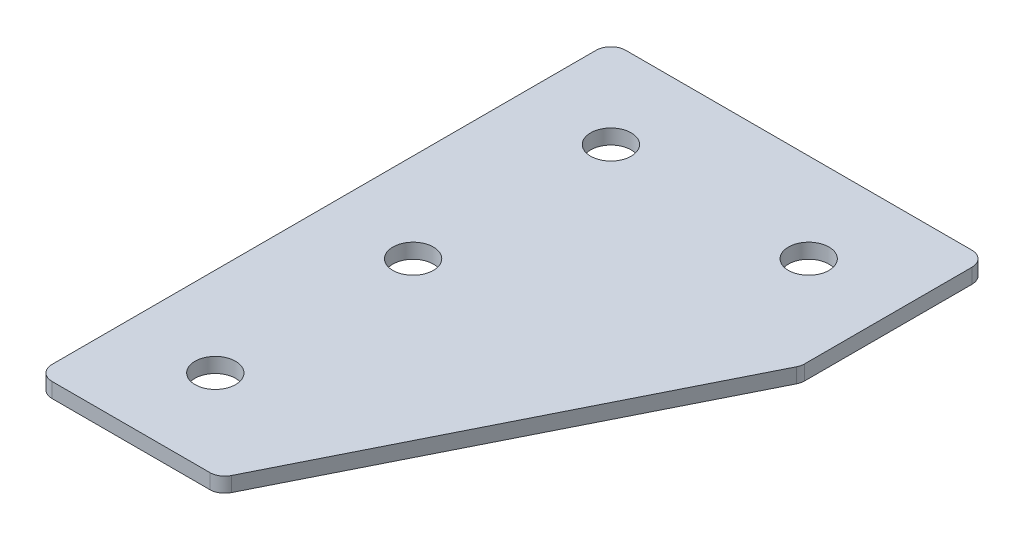
ISO-10303-21;
HEADER;
FILE_DESCRIPTION(('STEP AP214'),'2;1');
FILE_NAME('part.step','',(''),(''),'','','');
FILE_SCHEMA(('AUTOMOTIVE_DESIGN { 1 0 10303 214 1 1 1 1 }'));
ENDSEC;
DATA;
#1=APPLICATION_CONTEXT('core data for automotive mechanical design processes');
#2=APPLICATION_PROTOCOL_DEFINITION('international standard','automotive_design',2000,#1);
#3=PRODUCT_CONTEXT('',#1,'mechanical');
#4=PRODUCT('Part','Part','',(#3));
#5=PRODUCT_RELATED_PRODUCT_CATEGORY('part','',(#4));
#6=PRODUCT_DEFINITION_FORMATION('','',#4);
#7=PRODUCT_DEFINITION_CONTEXT('part definition',#1,'design');
#8=PRODUCT_DEFINITION('design','',#6,#7);
#9=PRODUCT_DEFINITION_SHAPE('','',#8);
#10=(LENGTH_UNIT() NAMED_UNIT(*) SI_UNIT(.MILLI.,.METRE.));
#11=(NAMED_UNIT(*) PLANE_ANGLE_UNIT() SI_UNIT($,.RADIAN.));
#12=(NAMED_UNIT(*) SI_UNIT($,.STERADIAN.) SOLID_ANGLE_UNIT());
#13=UNCERTAINTY_MEASURE_WITH_UNIT(LENGTH_MEASURE(1.E-05),#10,'distance_accuracy_value','');
#14=(GEOMETRIC_REPRESENTATION_CONTEXT(3) GLOBAL_UNCERTAINTY_ASSIGNED_CONTEXT((#13)) GLOBAL_UNIT_ASSIGNED_CONTEXT((#10,
#11,#12)) REPRESENTATION_CONTEXT('',''));
#15=CARTESIAN_POINT('',(0.,0.,0.));
#16=DIRECTION('',(0.,0.,1.));
#17=DIRECTION('',(1.,0.,0.));
#18=AXIS2_PLACEMENT_3D('',#15,#16,#17);
#19=CARTESIAN_POINT('',(-21.4535127194222,1.20798729377475,-41.2540344861804));
#20=DIRECTION('',(0.,-1.,0.));
#21=DIRECTION('',(0.,0.,-1.));
#22=AXIS2_PLACEMENT_3D('',#19,#20,#21);
#23=PLANE('',#22);
#24=CARTESIAN_POINT('',(-21.4535127194222,1.20798729377475,38.7459655138196));
#25=DIRECTION('',(0.,1.,0.));
#26=DIRECTION('',(0.,0.,1.));
#27=AXIS2_PLACEMENT_3D('',#24,#25,#26);
#28=CIRCLE('',#27,4.1);
#29=CARTESIAN_POINT('',(-21.4535127194222,1.20798729377475,42.8459655138196));
#30=VERTEX_POINT('',#29);
#31=EDGE_CURVE('E245',#30,#30,#28,.T.);
#32=ORIENTED_EDGE('',*,*,#31,.T.);
#33=EDGE_LOOP('',(#32));
#34=FACE_BOUND('',#33,.T.);
#35=CARTESIAN_POINT('',(-21.4535127194222,1.20798729377475,-1.25403448618041));
#36=DIRECTION('',(0.,1.,0.));
#37=DIRECTION('',(0.,0.,1.));
#38=AXIS2_PLACEMENT_3D('',#35,#36,#37);
#39=CIRCLE('',#38,4.1);
#40=CARTESIAN_POINT('',(-21.4535127194222,1.20798729377475,2.84596551381959));
#41=VERTEX_POINT('',#40);
#42=EDGE_CURVE('E253',#41,#41,#39,.T.);
#43=ORIENTED_EDGE('',*,*,#42,.T.);
#44=EDGE_LOOP('',(#43));
#45=FACE_BOUND('',#44,.T.);
#46=CARTESIAN_POINT('',(18.5464872805778,1.20798729377475,-41.2540344861804));
#47=DIRECTION('',(0.,1.,0.));
#48=DIRECTION('',(0.,0.,1.));
#49=AXIS2_PLACEMENT_3D('',#46,#47,#48);
#50=CIRCLE('',#49,4.1);
#51=CARTESIAN_POINT('',(18.5464872805778,1.20798729377475,-37.1540344861804));
#52=VERTEX_POINT('',#51);
#53=EDGE_CURVE('E259',#52,#52,#50,.T.);
#54=ORIENTED_EDGE('',*,*,#53,.T.);
#55=EDGE_LOOP('',(#54));
#56=FACE_BOUND('',#55,.T.);
#57=CARTESIAN_POINT('',(-21.4535127194222,1.20798729377475,-41.2540344861804));
#58=DIRECTION('',(0.,1.,0.));
#59=DIRECTION('',(0.,0.,1.));
#60=AXIS2_PLACEMENT_3D('',#57,#58,#59);
#61=CIRCLE('',#60,4.1);
#62=CARTESIAN_POINT('',(-21.4535127194222,1.20798729377475,-37.1540344861804));
#63=VERTEX_POINT('',#62);
#64=EDGE_CURVE('E176',#63,#63,#61,.T.);
#65=ORIENTED_EDGE('',*,*,#64,.T.);
#66=EDGE_LOOP('',(#65));
#67=FACE_BOUND('',#66,.T.);
#68=DIRECTION('',(1.,0.,0.));
#69=VECTOR('',#68,1.);
#70=CARTESIAN_POINT('',(-39.4535127194222,1.20798729377475,56.7459655138196));
#71=LINE('',#70,#69);
#72=CARTESIAN_POINT('',(-36.4535127194222,1.20798729377475,56.7459655138196));
#73=VERTEX_POINT('',#72);
#74=CARTESIAN_POINT('',(-4.54368266317168,1.20798729377475,56.7459655138196));
#75=VERTEX_POINT('',#74);
#76=EDGE_CURVE('E165',#73,#75,#71,.T.);
#77=ORIENTED_EDGE('',*,*,#76,.F.);
#78=CARTESIAN_POINT('',(-36.4535127194222,1.20798729377475,53.7459655138196));
#79=DIRECTION('',(0.,-1.,0.));
#80=DIRECTION('',(0.,0.,-1.));
#81=AXIS2_PLACEMENT_3D('',#78,#79,#80);
#82=CIRCLE('',#81,3.);
#83=CARTESIAN_POINT('',(-39.4535127194222,1.20798729377475,53.7459655138196));
#84=VERTEX_POINT('',#83);
#85=EDGE_CURVE('E146',#73,#84,#82,.T.);
#86=ORIENTED_EDGE('',*,*,#85,.T.);
#87=DIRECTION('',(0.,0.,1.));
#88=VECTOR('',#87,1.);
#89=CARTESIAN_POINT('',(-39.4535127194222,1.20798729377475,-59.2540344861804));
#90=LINE('',#89,#88);
#91=CARTESIAN_POINT('',(-39.4535127194222,1.20798729377475,-56.2540344861804));
#92=VERTEX_POINT('',#91);
#93=EDGE_CURVE('E163',#92,#84,#90,.T.);
#94=ORIENTED_EDGE('',*,*,#93,.F.);
#95=CARTESIAN_POINT('',(-36.4535127194222,1.20798729377475,-56.2540344861804));
#96=DIRECTION('',(0.,-1.,0.));
#97=DIRECTION('',(0.,0.,-1.));
#98=AXIS2_PLACEMENT_3D('',#95,#96,#97);
#99=CIRCLE('',#98,3.);
#100=CARTESIAN_POINT('',(-36.4535127194222,1.20798729377475,-59.2540344861804));
#101=VERTEX_POINT('',#100);
#102=EDGE_CURVE('E117',#92,#101,#99,.T.);
#103=ORIENTED_EDGE('',*,*,#102,.T.);
#104=DIRECTION('',(-1.,0.,0.));
#105=VECTOR('',#104,1.);
#106=CARTESIAN_POINT('',(36.5464872805778,1.20798729377475,-59.2540344861804));
#107=LINE('',#106,#105);
#108=CARTESIAN_POINT('',(33.5464872805778,1.20798729377475,-59.2540344861804));
#109=VERTEX_POINT('',#108);
#110=EDGE_CURVE('E161',#109,#101,#107,.T.);
#111=ORIENTED_EDGE('',*,*,#110,.F.);
#112=CARTESIAN_POINT('',(33.5464872805778,1.20798729377475,-56.2540344861804));
#113=DIRECTION('',(0.,-1.,0.));
#114=DIRECTION('',(0.,0.,-1.));
#115=AXIS2_PLACEMENT_3D('',#112,#113,#114);
#116=CIRCLE('',#115,3.);
#117=CARTESIAN_POINT('',(36.5464872805778,1.20798729377475,-56.2540344861804));
#118=VERTEX_POINT('',#117);
#119=EDGE_CURVE('E141',#109,#118,#116,.T.);
#120=ORIENTED_EDGE('',*,*,#119,.T.);
#121=DIRECTION('',(0.,0.,-1.));
#122=VECTOR('',#121,1.);
#123=CARTESIAN_POINT('',(36.5464872805778,1.20798729377475,-21.72617044118));
#124=LINE('',#123,#122);
#125=CARTESIAN_POINT('',(36.5464872805778,1.20798729377475,-22.4343743736794));
#126=VERTEX_POINT('',#125);
#127=EDGE_CURVE('E118',#126,#118,#124,.T.);
#128=ORIENTED_EDGE('',*,*,#127,.F.);
#129=CARTESIAN_POINT('',(33.5464872805778,1.20798729377475,-22.4343743736794));
#130=DIRECTION('',(0.,-1.,0.));
#131=DIRECTION('',(0.,0.,-1.));
#132=AXIS2_PLACEMENT_3D('',#129,#130,#131);
#133=CIRCLE('',#132,3.);
#134=CARTESIAN_POINT('',(36.2297688535776,1.20798729377475,-21.0927335871795));
#135=VERTEX_POINT('',#134);
#136=EDGE_CURVE('E31',#126,#135,#133,.T.);
#137=ORIENTED_EDGE('',*,*,#136,.T.);
#138=DIRECTION('',(0.447213595499958,0.,-0.894427190999916));
#139=VECTOR('',#138,1.);
#140=CARTESIAN_POINT('',(-2.68958069692201,1.20798729377475,56.7459655138196));
#141=LINE('',#140,#139);
#142=CARTESIAN_POINT('',(-1.86040109017194,1.20798729377475,55.0876063003194));
#143=VERTEX_POINT('',#142);
#144=EDGE_CURVE('E122',#143,#135,#141,.T.);
#145=ORIENTED_EDGE('',*,*,#144,.F.);
#146=CARTESIAN_POINT('',(-4.54368266317168,1.20798729377475,53.7459655138196));
#147=DIRECTION('',(0.,-1.,0.));
#148=DIRECTION('',(0.,0.,-1.));
#149=AXIS2_PLACEMENT_3D('',#146,#147,#148);
#150=CIRCLE('',#149,3.);
#151=EDGE_CURVE('E144',#143,#75,#150,.T.);
#152=ORIENTED_EDGE('',*,*,#151,.T.);
#153=EDGE_LOOP('',(#77,#86,#94,#103,#111,#120,#128,#137,#145,#152));
#154=FACE_BOUND('',#153,.T.);
#155=ADVANCED_FACE('F16',(#34,#45,#56,#67,#154),#23,.T.);
#156=CARTESIAN_POINT('',(36.5464872805778,1.20798729377475,-59.2540344861804));
#157=DIRECTION('',(0.,0.,-1.));
#158=DIRECTION('',(-1.,0.,0.));
#159=AXIS2_PLACEMENT_3D('',#156,#157,#158);
#160=PLANE('',#159);
#161=DIRECTION('',(-1.,0.,0.));
#162=VECTOR('',#161,1.);
#163=CARTESIAN_POINT('',(36.5464872805778,4.20798729377475,-59.2540344861804));
#164=LINE('',#163,#162);
#165=CARTESIAN_POINT('',(33.5464872805778,4.20798729377475,-59.2540344861804));
#166=VERTEX_POINT('',#165);
#167=CARTESIAN_POINT('',(-36.4535127194222,4.20798729377475,-59.2540344861804));
#168=VERTEX_POINT('',#167);
#169=EDGE_CURVE('E99',#166,#168,#164,.T.);
#170=ORIENTED_EDGE('',*,*,#169,.F.);
#171=DIRECTION('',(0.,1.,0.));
#172=VECTOR('',#171,1.);
#173=CARTESIAN_POINT('',(33.5464872805778,1.20798729377475,-59.2540344861804));
#174=LINE('',#173,#172);
#175=EDGE_CURVE('E10',#166,#109,#174,.F.);
#176=ORIENTED_EDGE('',*,*,#175,.T.);
#177=ORIENTED_EDGE('',*,*,#110,.T.);
#178=DIRECTION('',(0.,1.,0.));
#179=VECTOR('',#178,1.);
#180=CARTESIAN_POINT('',(-36.4535127194222,1.20798729377475,-59.2540344861804));
#181=LINE('',#180,#179);
#182=EDGE_CURVE('E24',#101,#168,#181,.T.);
#183=ORIENTED_EDGE('',*,*,#182,.T.);
#184=EDGE_LOOP('',(#170,#176,#177,#183));
#185=FACE_BOUND('',#184,.T.);
#186=ADVANCED_FACE('F158',(#185),#160,.T.);
#187=CARTESIAN_POINT('',(36.5464872805778,1.20798729377475,-21.72617044118));
#188=DIRECTION('',(1.,0.,0.));
#189=DIRECTION('',(0.,0.,-1.));
#190=AXIS2_PLACEMENT_3D('',#187,#188,#189);
#191=PLANE('',#190);
#192=DIRECTION('',(0.,0.,-1.));
#193=VECTOR('',#192,1.);
#194=CARTESIAN_POINT('',(36.5464872805778,4.20798729377475,-21.72617044118));
#195=LINE('',#194,#193);
#196=CARTESIAN_POINT('',(36.5464872805778,4.20798729377475,-22.4343743736794));
#197=VERTEX_POINT('',#196);
#198=CARTESIAN_POINT('',(36.5464872805778,4.20798729377475,-56.2540344861804));
#199=VERTEX_POINT('',#198);
#200=EDGE_CURVE('E125',#197,#199,#195,.T.);
#201=ORIENTED_EDGE('',*,*,#200,.F.);
#202=DIRECTION('',(0.,1.,0.));
#203=VECTOR('',#202,1.);
#204=CARTESIAN_POINT('',(36.5464872805778,1.20798729377475,-22.4343743736794));
#205=LINE('',#204,#203);
#206=EDGE_CURVE('E155',#197,#126,#205,.F.);
#207=ORIENTED_EDGE('',*,*,#206,.T.);
#208=ORIENTED_EDGE('',*,*,#127,.T.);
#209=DIRECTION('',(0.,1.,0.));
#210=VECTOR('',#209,1.);
#211=CARTESIAN_POINT('',(36.5464872805778,1.20798729377475,-56.2540344861804));
#212=LINE('',#211,#210);
#213=EDGE_CURVE('E152',#118,#199,#212,.T.);
#214=ORIENTED_EDGE('',*,*,#213,.T.);
#215=EDGE_LOOP('',(#201,#207,#208,#214));
#216=FACE_BOUND('',#215,.T.);
#217=ADVANCED_FACE('F212',(#216),#191,.T.);
#218=CARTESIAN_POINT('',(-2.68958069692201,1.20798729377475,56.7459655138196));
#219=DIRECTION('',(0.894427190999916,0.,0.447213595499958));
#220=DIRECTION('',(0.447213595499958,0.,-0.894427190999916));
#221=AXIS2_PLACEMENT_3D('',#218,#219,#220);
#222=PLANE('',#221);
#223=DIRECTION('',(0.447213595499958,0.,-0.894427190999916));
#224=VECTOR('',#223,1.);
#225=CARTESIAN_POINT('',(-2.68958069692201,4.20798729377475,56.7459655138196));
#226=LINE('',#225,#224);
#227=CARTESIAN_POINT('',(-1.86040109017194,4.20798729377475,55.0876063003194));
#228=VERTEX_POINT('',#227);
#229=CARTESIAN_POINT('',(36.2297688535776,4.20798729377475,-21.0927335871795));
#230=VERTEX_POINT('',#229);
#231=EDGE_CURVE('E168',#228,#230,#226,.T.);
#232=ORIENTED_EDGE('',*,*,#231,.F.);
#233=DIRECTION('',(0.,1.,0.));
#234=VECTOR('',#233,1.);
#235=CARTESIAN_POINT('',(-1.86040109017194,1.20798729377475,55.0876063003194));
#236=LINE('',#235,#234);
#237=EDGE_CURVE('E38',#228,#143,#236,.F.);
#238=ORIENTED_EDGE('',*,*,#237,.T.);
#239=ORIENTED_EDGE('',*,*,#144,.T.);
#240=DIRECTION('',(0.,1.,0.));
#241=VECTOR('',#240,1.);
#242=CARTESIAN_POINT('',(36.2297688535776,1.20798729377475,-21.0927335871795));
#243=LINE('',#242,#241);
#244=EDGE_CURVE('E148',#135,#230,#243,.T.);
#245=ORIENTED_EDGE('',*,*,#244,.T.);
#246=EDGE_LOOP('',(#232,#238,#239,#245));
#247=FACE_BOUND('',#246,.T.);
#248=ADVANCED_FACE('F181',(#247),#222,.T.);
#249=CARTESIAN_POINT('',(-39.4535127194222,1.20798729377475,56.7459655138196));
#250=DIRECTION('',(0.,0.,1.));
#251=DIRECTION('',(1.,0.,0.));
#252=AXIS2_PLACEMENT_3D('',#249,#250,#251);
#253=PLANE('',#252);
#254=DIRECTION('',(1.,0.,0.));
#255=VECTOR('',#254,1.);
#256=CARTESIAN_POINT('',(-39.4535127194222,4.20798729377475,56.7459655138196));
#257=LINE('',#256,#255);
#258=CARTESIAN_POINT('',(-36.4535127194222,4.20798729377475,56.7459655138196));
#259=VERTEX_POINT('',#258);
#260=CARTESIAN_POINT('',(-4.54368266317168,4.20798729377475,56.7459655138196));
#261=VERTEX_POINT('',#260);
#262=EDGE_CURVE('E114',#259,#261,#257,.T.);
#263=ORIENTED_EDGE('',*,*,#262,.F.);
#264=DIRECTION('',(0.,1.,0.));
#265=VECTOR('',#264,1.);
#266=CARTESIAN_POINT('',(-36.4535127194222,1.20798729377475,56.7459655138196));
#267=LINE('',#266,#265);
#268=EDGE_CURVE('E138',#259,#73,#267,.F.);
#269=ORIENTED_EDGE('',*,*,#268,.T.);
#270=ORIENTED_EDGE('',*,*,#76,.T.);
#271=DIRECTION('',(0.,1.,0.));
#272=VECTOR('',#271,1.);
#273=CARTESIAN_POINT('',(-4.54368266317168,1.20798729377475,56.7459655138196));
#274=LINE('',#273,#272);
#275=EDGE_CURVE('E135',#75,#261,#274,.T.);
#276=ORIENTED_EDGE('',*,*,#275,.T.);
#277=EDGE_LOOP('',(#263,#269,#270,#276));
#278=FACE_BOUND('',#277,.T.);
#279=ADVANCED_FACE('F191',(#278),#253,.T.);
#280=CARTESIAN_POINT('',(-39.4535127194222,1.20798729377475,-59.2540344861804));
#281=DIRECTION('',(-1.,0.,0.));
#282=DIRECTION('',(0.,0.,1.));
#283=AXIS2_PLACEMENT_3D('',#280,#281,#282);
#284=PLANE('',#283);
#285=ORIENTED_EDGE('',*,*,#93,.T.);
#286=DIRECTION('',(0.,1.,0.));
#287=VECTOR('',#286,1.);
#288=CARTESIAN_POINT('',(-39.4535127194222,1.20798729377475,53.7459655138196));
#289=LINE('',#288,#287);
#290=CARTESIAN_POINT('',(-39.4535127194222,4.20798729377475,53.7459655138196));
#291=VERTEX_POINT('',#290);
#292=EDGE_CURVE('E105',#84,#291,#289,.T.);
#293=ORIENTED_EDGE('',*,*,#292,.T.);
#294=DIRECTION('',(0.,0.,1.));
#295=VECTOR('',#294,1.);
#296=CARTESIAN_POINT('',(-39.4535127194222,4.20798729377475,-59.2540344861804));
#297=LINE('',#296,#295);
#298=CARTESIAN_POINT('',(-39.4535127194222,4.20798729377475,-56.2540344861804));
#299=VERTEX_POINT('',#298);
#300=EDGE_CURVE('E97',#299,#291,#297,.T.);
#301=ORIENTED_EDGE('',*,*,#300,.F.);
#302=DIRECTION('',(0.,1.,0.));
#303=VECTOR('',#302,1.);
#304=CARTESIAN_POINT('',(-39.4535127194222,1.20798729377475,-56.2540344861804));
#305=LINE('',#304,#303);
#306=EDGE_CURVE('E111',#299,#92,#305,.F.);
#307=ORIENTED_EDGE('',*,*,#306,.T.);
#308=EDGE_LOOP('',(#285,#293,#301,#307));
#309=FACE_BOUND('',#308,.T.);
#310=ADVANCED_FACE('F110',(#309),#284,.T.);
#311=CARTESIAN_POINT('',(-21.4535127194222,4.20798729377475,-41.2540344861804));
#312=DIRECTION('',(0.,-1.,0.));
#313=DIRECTION('',(0.,0.,-1.));
#314=AXIS2_PLACEMENT_3D('',#311,#312,#313);
#315=PLANE('',#314);
#316=CARTESIAN_POINT('',(-21.4535127194222,4.20798729377475,38.7459655138196));
#317=DIRECTION('',(0.,1.,0.));
#318=DIRECTION('',(0.,0.,1.));
#319=AXIS2_PLACEMENT_3D('',#316,#317,#318);
#320=CIRCLE('',#319,4.1);
#321=CARTESIAN_POINT('',(-21.4535127194222,4.20798729377475,42.8459655138196));
#322=VERTEX_POINT('',#321);
#323=EDGE_CURVE('E248',#322,#322,#320,.T.);
#324=ORIENTED_EDGE('',*,*,#323,.F.);
#325=EDGE_LOOP('',(#324));
#326=FACE_BOUND('',#325,.T.);
#327=CARTESIAN_POINT('',(-21.4535127194222,4.20798729377475,-1.25403448618041));
#328=DIRECTION('',(0.,1.,0.));
#329=DIRECTION('',(0.,0.,1.));
#330=AXIS2_PLACEMENT_3D('',#327,#328,#329);
#331=CIRCLE('',#330,4.1);
#332=CARTESIAN_POINT('',(-21.4535127194222,4.20798729377475,2.84596551381959));
#333=VERTEX_POINT('',#332);
#334=EDGE_CURVE('E250',#333,#333,#331,.T.);
#335=ORIENTED_EDGE('',*,*,#334,.F.);
#336=EDGE_LOOP('',(#335));
#337=FACE_BOUND('',#336,.T.);
#338=CARTESIAN_POINT('',(18.5464872805778,4.20798729377475,-41.2540344861804));
#339=DIRECTION('',(0.,1.,0.));
#340=DIRECTION('',(0.,0.,1.));
#341=AXIS2_PLACEMENT_3D('',#338,#339,#340);
#342=CIRCLE('',#341,4.1);
#343=CARTESIAN_POINT('',(18.5464872805778,4.20798729377475,-37.1540344861804));
#344=VERTEX_POINT('',#343);
#345=EDGE_CURVE('E256',#344,#344,#342,.T.);
#346=ORIENTED_EDGE('',*,*,#345,.F.);
#347=EDGE_LOOP('',(#346));
#348=FACE_BOUND('',#347,.T.);
#349=CARTESIAN_POINT('',(-21.4535127194222,4.20798729377475,-41.2540344861804));
#350=DIRECTION('',(0.,1.,0.));
#351=DIRECTION('',(0.,0.,1.));
#352=AXIS2_PLACEMENT_3D('',#349,#350,#351);
#353=CIRCLE('',#352,4.1);
#354=CARTESIAN_POINT('',(-21.4535127194222,4.20798729377475,-37.1540344861804));
#355=VERTEX_POINT('',#354);
#356=EDGE_CURVE('E170',#355,#355,#353,.T.);
#357=ORIENTED_EDGE('',*,*,#356,.F.);
#358=EDGE_LOOP('',(#357));
#359=FACE_BOUND('',#358,.T.);
#360=ORIENTED_EDGE('',*,*,#300,.T.);
#361=CARTESIAN_POINT('',(-36.4535127194222,4.20798729377475,53.7459655138196));
#362=DIRECTION('',(0.,-1.,0.));
#363=DIRECTION('',(0.,0.,-1.));
#364=AXIS2_PLACEMENT_3D('',#361,#362,#363);
#365=CIRCLE('',#364,3.);
#366=EDGE_CURVE('E133',#291,#259,#365,.F.);
#367=ORIENTED_EDGE('',*,*,#366,.T.);
#368=ORIENTED_EDGE('',*,*,#262,.T.);
#369=CARTESIAN_POINT('',(-4.54368266317168,4.20798729377475,53.7459655138196));
#370=DIRECTION('',(0.,-1.,0.));
#371=DIRECTION('',(0.,0.,-1.));
#372=AXIS2_PLACEMENT_3D('',#369,#370,#371);
#373=CIRCLE('',#372,3.);
#374=EDGE_CURVE('E131',#261,#228,#373,.F.);
#375=ORIENTED_EDGE('',*,*,#374,.T.);
#376=ORIENTED_EDGE('',*,*,#231,.T.);
#377=CARTESIAN_POINT('',(33.5464872805778,4.20798729377475,-22.4343743736794));
#378=DIRECTION('',(0.,-1.,0.));
#379=DIRECTION('',(0.,0.,-1.));
#380=AXIS2_PLACEMENT_3D('',#377,#378,#379);
#381=CIRCLE('',#380,3.);
#382=EDGE_CURVE('E129',#230,#197,#381,.F.);
#383=ORIENTED_EDGE('',*,*,#382,.T.);
#384=ORIENTED_EDGE('',*,*,#200,.T.);
#385=CARTESIAN_POINT('',(33.5464872805778,4.20798729377475,-56.2540344861804));
#386=DIRECTION('',(0.,-1.,0.));
#387=DIRECTION('',(0.,0.,-1.));
#388=AXIS2_PLACEMENT_3D('',#385,#386,#387);
#389=CIRCLE('',#388,3.);
#390=EDGE_CURVE('E104',#199,#166,#389,.F.);
#391=ORIENTED_EDGE('',*,*,#390,.T.);
#392=ORIENTED_EDGE('',*,*,#169,.T.);
#393=CARTESIAN_POINT('',(-36.4535127194222,4.20798729377475,-56.2540344861804));
#394=DIRECTION('',(0.,-1.,0.));
#395=DIRECTION('',(0.,0.,-1.));
#396=AXIS2_PLACEMENT_3D('',#393,#394,#395);
#397=CIRCLE('',#396,3.);
#398=EDGE_CURVE('E94',#168,#299,#397,.F.);
#399=ORIENTED_EDGE('',*,*,#398,.T.);
#400=EDGE_LOOP('',(#360,#367,#368,#375,#376,#383,#384,#391,#392,#399));
#401=FACE_BOUND('',#400,.T.);
#402=ADVANCED_FACE('F96',(#326,#337,#348,#359,#401),#315,.F.);
#403=CARTESIAN_POINT('',(-36.4535127194222,1.20798729377475,53.7459655138196));
#404=DIRECTION('',(0.,1.,0.));
#405=DIRECTION('',(0.,0.,1.));
#406=AXIS2_PLACEMENT_3D('',#403,#404,#405);
#407=CYLINDRICAL_SURFACE('',#406,3.);
#408=ORIENTED_EDGE('',*,*,#85,.F.);
#409=ORIENTED_EDGE('',*,*,#268,.F.);
#410=ORIENTED_EDGE('',*,*,#366,.F.);
#411=ORIENTED_EDGE('',*,*,#292,.F.);
#412=EDGE_LOOP('',(#408,#409,#410,#411));
#413=FACE_BOUND('',#412,.T.);
#414=ADVANCED_FACE('F194',(#413),#407,.T.);
#415=CARTESIAN_POINT('',(-4.54368266317168,1.20798729377475,53.7459655138196));
#416=DIRECTION('',(0.,1.,0.));
#417=DIRECTION('',(0.,0.,1.));
#418=AXIS2_PLACEMENT_3D('',#415,#416,#417);
#419=CYLINDRICAL_SURFACE('',#418,3.);
#420=ORIENTED_EDGE('',*,*,#151,.F.);
#421=ORIENTED_EDGE('',*,*,#237,.F.);
#422=ORIENTED_EDGE('',*,*,#374,.F.);
#423=ORIENTED_EDGE('',*,*,#275,.F.);
#424=EDGE_LOOP('',(#420,#421,#422,#423));
#425=FACE_BOUND('',#424,.T.);
#426=ADVANCED_FACE('F185',(#425),#419,.T.);
#427=CARTESIAN_POINT('',(33.5464872805778,1.20798729377475,-22.4343743736794));
#428=DIRECTION('',(0.,1.,0.));
#429=DIRECTION('',(0.,0.,1.));
#430=AXIS2_PLACEMENT_3D('',#427,#428,#429);
#431=CYLINDRICAL_SURFACE('',#430,3.);
#432=ORIENTED_EDGE('',*,*,#136,.F.);
#433=ORIENTED_EDGE('',*,*,#206,.F.);
#434=ORIENTED_EDGE('',*,*,#382,.F.);
#435=ORIENTED_EDGE('',*,*,#244,.F.);
#436=EDGE_LOOP('',(#432,#433,#434,#435));
#437=FACE_BOUND('',#436,.T.);
#438=ADVANCED_FACE('F202',(#437),#431,.T.);
#439=CARTESIAN_POINT('',(33.5464872805778,1.20798729377475,-56.2540344861804));
#440=DIRECTION('',(0.,1.,0.));
#441=DIRECTION('',(0.,0.,1.));
#442=AXIS2_PLACEMENT_3D('',#439,#440,#441);
#443=CYLINDRICAL_SURFACE('',#442,3.);
#444=ORIENTED_EDGE('',*,*,#119,.F.);
#445=ORIENTED_EDGE('',*,*,#175,.F.);
#446=ORIENTED_EDGE('',*,*,#390,.F.);
#447=ORIENTED_EDGE('',*,*,#213,.F.);
#448=EDGE_LOOP('',(#444,#445,#446,#447));
#449=FACE_BOUND('',#448,.T.);
#450=ADVANCED_FACE('F299',(#449),#443,.T.);
#451=CARTESIAN_POINT('',(-36.4535127194222,1.20798729377475,-56.2540344861804));
#452=DIRECTION('',(0.,1.,0.));
#453=DIRECTION('',(0.,0.,1.));
#454=AXIS2_PLACEMENT_3D('',#451,#452,#453);
#455=CYLINDRICAL_SURFACE('',#454,3.);
#456=ORIENTED_EDGE('',*,*,#102,.F.);
#457=ORIENTED_EDGE('',*,*,#306,.F.);
#458=ORIENTED_EDGE('',*,*,#398,.F.);
#459=ORIENTED_EDGE('',*,*,#182,.F.);
#460=EDGE_LOOP('',(#456,#457,#458,#459));
#461=FACE_BOUND('',#460,.T.);
#462=ADVANCED_FACE('F18',(#461),#455,.T.);
#463=CARTESIAN_POINT('',(-21.4535127194222,1.20798729377475,-41.2540344861804));
#464=DIRECTION('',(0.,1.,0.));
#465=DIRECTION('',(0.,0.,1.));
#466=AXIS2_PLACEMENT_3D('',#463,#464,#465);
#467=CYLINDRICAL_SURFACE('',#466,4.1);
#468=ORIENTED_EDGE('',*,*,#64,.F.);
#469=EDGE_LOOP('',(#468));
#470=FACE_BOUND('',#469,.T.);
#471=ORIENTED_EDGE('',*,*,#356,.T.);
#472=EDGE_LOOP('',(#471));
#473=FACE_BOUND('',#472,.T.);
#474=ADVANCED_FACE('F226',(#470,#473),#467,.F.);
#475=CARTESIAN_POINT('',(18.5464872805778,1.20798729377475,-41.2540344861804));
#476=DIRECTION('',(0.,1.,0.));
#477=DIRECTION('',(0.,0.,1.));
#478=AXIS2_PLACEMENT_3D('',#475,#476,#477);
#479=CYLINDRICAL_SURFACE('',#478,4.1);
#480=ORIENTED_EDGE('',*,*,#53,.F.);
#481=EDGE_LOOP('',(#480));
#482=FACE_BOUND('',#481,.T.);
#483=ORIENTED_EDGE('',*,*,#345,.T.);
#484=EDGE_LOOP('',(#483));
#485=FACE_BOUND('',#484,.T.);
#486=ADVANCED_FACE('F229',(#482,#485),#479,.F.);
#487=CARTESIAN_POINT('',(-21.4535127194222,1.20798729377475,-1.25403448618041));
#488=DIRECTION('',(0.,1.,0.));
#489=DIRECTION('',(0.,0.,1.));
#490=AXIS2_PLACEMENT_3D('',#487,#488,#489);
#491=CYLINDRICAL_SURFACE('',#490,4.1);
#492=ORIENTED_EDGE('',*,*,#42,.F.);
#493=EDGE_LOOP('',(#492));
#494=FACE_BOUND('',#493,.T.);
#495=ORIENTED_EDGE('',*,*,#334,.T.);
#496=EDGE_LOOP('',(#495));
#497=FACE_BOUND('',#496,.T.);
#498=ADVANCED_FACE('F233',(#494,#497),#491,.F.);
#499=CARTESIAN_POINT('',(-21.4535127194222,1.20798729377475,38.7459655138196));
#500=DIRECTION('',(0.,1.,0.));
#501=DIRECTION('',(0.,0.,1.));
#502=AXIS2_PLACEMENT_3D('',#499,#500,#501);
#503=CYLINDRICAL_SURFACE('',#502,4.1);
#504=ORIENTED_EDGE('',*,*,#31,.F.);
#505=EDGE_LOOP('',(#504));
#506=FACE_BOUND('',#505,.T.);
#507=ORIENTED_EDGE('',*,*,#323,.T.);
#508=EDGE_LOOP('',(#507));
#509=FACE_BOUND('',#508,.T.);
#510=ADVANCED_FACE('F237',(#506,#509),#503,.F.);
#511=CLOSED_SHELL('',(#155,#186,#217,#248,#279,#310,#402,#414,#426,#438,#450,#462,#474,#486,
#498,#510));
#512=MANIFOLD_SOLID_BREP('B1',#511);
#513=ADVANCED_BREP_SHAPE_REPRESENTATION('',(#18,#512),#14);
#514=SHAPE_DEFINITION_REPRESENTATION(#9,#513);
ENDSEC;
END-ISO-10303-21;
